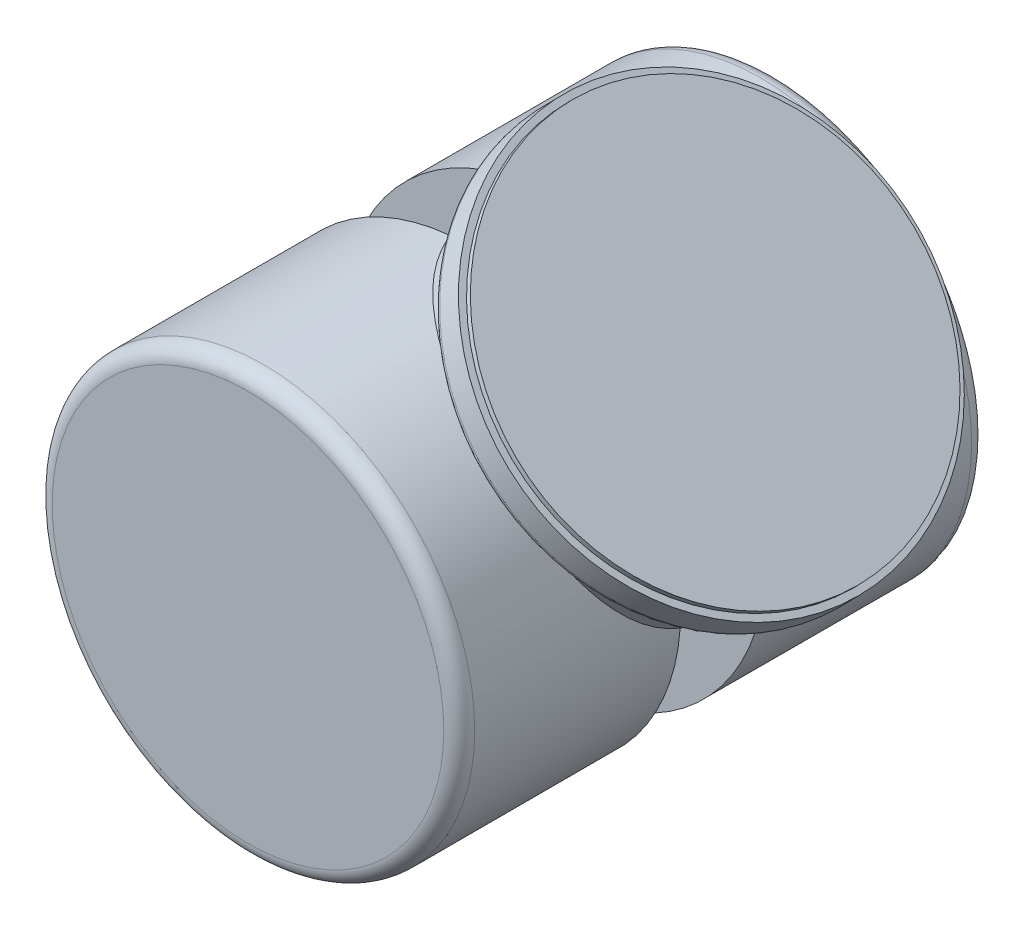
ISO-10303-21;
HEADER;
FILE_DESCRIPTION(('STEP AP214'),'2;1');
FILE_NAME('part.step','',(''),(''),'','','');
FILE_SCHEMA(('AUTOMOTIVE_DESIGN { 1 0 10303 214 1 1 1 1 }'));
ENDSEC;
DATA;
#1=APPLICATION_CONTEXT('core data for automotive mechanical design processes');
#2=APPLICATION_PROTOCOL_DEFINITION('international standard','automotive_design',2000,#1);
#3=PRODUCT_CONTEXT('',#1,'mechanical');
#4=PRODUCT('Part','Part','',(#3));
#5=PRODUCT_RELATED_PRODUCT_CATEGORY('part','',(#4));
#6=PRODUCT_DEFINITION_FORMATION('','',#4);
#7=PRODUCT_DEFINITION_CONTEXT('part definition',#1,'design');
#8=PRODUCT_DEFINITION('design','',#6,#7);
#9=PRODUCT_DEFINITION_SHAPE('','',#8);
#10=(LENGTH_UNIT() NAMED_UNIT(*) SI_UNIT(.MILLI.,.METRE.));
#11=(NAMED_UNIT(*) PLANE_ANGLE_UNIT() SI_UNIT($,.RADIAN.));
#12=(NAMED_UNIT(*) SI_UNIT($,.STERADIAN.) SOLID_ANGLE_UNIT());
#13=UNCERTAINTY_MEASURE_WITH_UNIT(LENGTH_MEASURE(1.E-05),#10,'distance_accuracy_value','');
#14=(GEOMETRIC_REPRESENTATION_CONTEXT(3) GLOBAL_UNCERTAINTY_ASSIGNED_CONTEXT((#13)) GLOBAL_UNIT_ASSIGNED_CONTEXT((#10,
#11,#12)) REPRESENTATION_CONTEXT('',''));
#15=CARTESIAN_POINT('',(0.,0.,0.));
#16=DIRECTION('',(0.,0.,1.));
#17=DIRECTION('',(1.,0.,0.));
#18=AXIS2_PLACEMENT_3D('',#15,#16,#17);
#19=CARTESIAN_POINT('',(-10.2728885897639,17.7877716934821,91.179723483677));
#20=DIRECTION('',(0.,0.,-1.));
#21=DIRECTION('',(-1.,0.,0.));
#22=AXIS2_PLACEMENT_3D('',#19,#20,#21);
#23=CYLINDRICAL_SURFACE('',#22,72.9880409571441);
#24=CARTESIAN_POINT('',(-10.2728885897639,17.7877716934821,-85.839210669677));
#25=DIRECTION('',(0.,0.,1.));
#26=DIRECTION('',(1.,0.,0.));
#27=AXIS2_PLACEMENT_3D('',#24,#25,#26);
#28=CIRCLE('',#27,72.9880409571441);
#29=CARTESIAN_POINT('',(62.7151523673802,17.7877716934821,-85.839210669677));
#30=VERTEX_POINT('',#29);
#31=EDGE_CURVE('E119',#30,#30,#28,.T.);
#32=ORIENTED_EDGE('',*,*,#31,.T.);
#33=EDGE_LOOP('',(#32));
#34=FACE_BOUND('',#33,.T.);
#35=CARTESIAN_POINT('',(-10.2728885897639,17.7877716934821,-14.6864102385));
#36=DIRECTION('',(0.,0.,1.));
#37=DIRECTION('',(1.,0.,0.));
#38=AXIS2_PLACEMENT_3D('',#35,#36,#37);
#39=CIRCLE('',#38,72.9880409571441);
#40=CARTESIAN_POINT('',(-16.9343529286447,90.4711880662941,-14.6864102385));
#41=VERTEX_POINT('',#40);
#42=CARTESIAN_POINT('',(62.5395750697728,12.7282007047142,-14.6864102385));
#43=VERTEX_POINT('',#42);
#44=EDGE_CURVE('E46',#41,#43,#39,.T.);
#45=ORIENTED_EDGE('',*,*,#44,.F.);
#46=CARTESIAN_POINT('',(-12.460816977514,90.7430120270717,-23.0457855003548));
#47=CARTESIAN_POINT('',(-11.9340405390179,90.7588120435122,-23.8551228879082));
#48=CARTESIAN_POINT('',(-11.3881053483468,90.7694651302793,-24.651996051726));
#49=CARTESIAN_POINT('',(-10.2618581155566,90.7779839909645,-26.2212619687137));
#50=CARTESIAN_POINT('',(-9.68154228267833,90.7758483522088,-26.9936520079439));
#51=CARTESIAN_POINT('',(-8.48987887696964,90.756465774077,-28.5144142634714));
#52=CARTESIAN_POINT('',(-7.87851794744228,90.7392122776759,-29.2627759119824));
#53=CARTESIAN_POINT('',(-6.62806677772549,90.6874354779252,-30.7352856678141));
#54=CARTESIAN_POINT('',(-5.98897741390968,90.6529127200184,-31.4594345391151));
#55=CARTESIAN_POINT('',(-4.68475511102175,90.5645175895748,-32.8846410294117));
#56=CARTESIAN_POINT('',(-4.01958482280416,90.5106164922079,-33.5856626733933));
#57=CARTESIAN_POINT('',(-2.66648075490148,90.3815635382052,-34.9633577484608));
#58=CARTESIAN_POINT('',(-1.97854682005504,90.3064115366927,-35.6400310135178));
#59=CARTESIAN_POINT('',(-0.582201910021823,90.133051592688,-36.9686029353508));
#60=CARTESIAN_POINT('',(0.126205059318272,90.0348481341226,-37.6205063816891));
#61=CARTESIAN_POINT('',(1.56156053767148,89.8136520626764,-38.8991213189813));
#62=CARTESIAN_POINT('',(2.28850902592742,89.6906594775458,-39.5258328381355));
#63=CARTESIAN_POINT('',(4.49913442568045,89.2810685649075,-41.371228637966));
#64=CARTESIAN_POINT('',(6.00828969956524,88.9543667605424,-42.5510953401129));
#65=CARTESIAN_POINT('',(9.07903094136688,88.181407026149,-44.7992657590915));
#66=CARTESIAN_POINT('',(10.640624102946,87.7351326335313,-45.8675540857973));
#67=CARTESIAN_POINT('',(13.0076754800586,86.9683757652841,-47.3763347548361));
#68=CARTESIAN_POINT('',(13.799891168629,86.6969284646599,-47.8631541348013));
#69=CARTESIAN_POINT('',(15.3911479565673,86.1202470714299,-48.8046173654142));
#70=CARTESIAN_POINT('',(16.1901886194247,85.8150151249043,-49.2592632567931));
#71=CARTESIAN_POINT('',(17.7923570498521,85.1698281590307,-50.1344068217745));
#72=CARTESIAN_POINT('',(18.5954824673839,84.8298913400642,-50.5549221889509));
#73=CARTESIAN_POINT('',(20.2039105935849,84.1141912916135,-51.3603100854198));
#74=CARTESIAN_POINT('',(21.0092137774569,83.7384195050016,-51.7451740579498));
#75=CARTESIAN_POINT('',(22.9489593390686,82.7889901391575,-52.6272007127063));
#76=CARTESIAN_POINT('',(24.0831332649281,82.1973147384143,-53.1058059716641));
#77=CARTESIAN_POINT('',(26.341792453711,80.9406675625587,-53.9826188172451));
#78=CARTESIAN_POINT('',(27.4662800383292,80.2757139099318,-54.3808462134863));
#79=CARTESIAN_POINT('',(29.1387111362293,79.2240323661206,-54.9139469186251));
#80=CARTESIAN_POINT('',(29.6937568411615,78.8644638470574,-55.0809286190994));
#81=CARTESIAN_POINT('',(30.798019687843,78.1274350282599,-55.3929388972209));
#82=CARTESIAN_POINT('',(31.3472378308829,77.7499778651322,-55.5379713049074));
#83=CARTESIAN_POINT('',(32.4387819192478,76.97742038648,-55.805570342904));
#84=CARTESIAN_POINT('',(32.981107110373,76.5823181612904,-55.928134534192));
#85=CARTESIAN_POINT('',(34.0576531936794,75.7749244975751,-56.1503066567562));
#86=CARTESIAN_POINT('',(34.5918737144183,75.3626322744468,-56.2499135388351));
#87=CARTESIAN_POINT('',(35.6531710042535,74.5197051265467,-56.4261175213798));
#88=CARTESIAN_POINT('',(36.1802095314599,74.0890019633498,-56.5026186647049));
#89=CARTESIAN_POINT('',(37.2237735458791,73.2114671954752,-56.6317423873246));
#90=CARTESIAN_POINT('',(37.7402979722484,72.764633975811,-56.6843625683916));
#91=CARTESIAN_POINT('',(38.7615897535056,71.8557040025734,-56.7654817499431));
#92=CARTESIAN_POINT('',(39.2663582779038,71.3936087784627,-56.7939831598851));
#93=CARTESIAN_POINT('',(40.2631583837219,70.4549417818142,-56.8267507282682));
#94=CARTESIAN_POINT('',(40.7551886379367,69.978368511957,-56.8310143714025));
#95=CARTESIAN_POINT('',(41.7253901935651,69.01180855014,-56.8152814734158));
#96=CARTESIAN_POINT('',(42.2035629645859,68.5218232913383,-56.7952875145617));
#97=CARTESIAN_POINT('',(43.1452203280086,67.529381593695,-56.731128977962));
#98=CARTESIAN_POINT('',(43.6087033033593,67.0269237926585,-56.6869617489341));
#99=CARTESIAN_POINT('',(44.5200305411271,66.010751444427,-56.5746507975141));
#100=CARTESIAN_POINT('',(44.9678769858662,65.4970384844845,-56.5065104357693));
#101=CARTESIAN_POINT('',(45.8472783683929,64.4594309220142,-56.346548878386));
#102=CARTESIAN_POINT('',(46.278831751186,63.9355353548596,-56.2547254289725));
#103=CARTESIAN_POINT('',(47.4948055018622,62.4168586156077,-55.957293235095));
#104=CARTESIAN_POINT('',(48.2580607135594,61.4106234031221,-55.7223682880931));
#105=CARTESIAN_POINT('',(49.7217986219112,59.3746024129492,-55.1738803481642));
#106=CARTESIAN_POINT('',(50.4222845049317,58.3448178340355,-54.8603213500188));
#107=CARTESIAN_POINT('',(51.7591048704046,56.2690648608736,-54.158471024652));
#108=CARTESIAN_POINT('',(52.3954312922362,55.2230944521258,-53.7701703251016));
#109=CARTESIAN_POINT('',(53.6034481269408,53.1224041183685,-52.9232510798212));
#110=CARTESIAN_POINT('',(54.1751348305662,52.0676836949773,-52.4646285023362));
#111=CARTESIAN_POINT('',(55.2987921287767,49.869764728542,-51.4413234417483));
#112=CARTESIAN_POINT('',(55.8453127772874,48.726394886213,-50.871030764956));
#113=CARTESIAN_POINT('',(56.8655574004808,46.4451418742561,-49.6590603693155));
#114=CARTESIAN_POINT('',(57.3392781479352,45.3072589500284,-49.0173794879921));
#115=CARTESIAN_POINT('',(58.2170474373938,43.0436017206231,-47.6676246660628));
#116=CARTESIAN_POINT('',(58.6210721151461,41.9178316861772,-46.9595281120347));
#117=CARTESIAN_POINT('',(59.3629057142515,39.6851325305964,-45.4817574769344));
#118=CARTESIAN_POINT('',(59.700711313206,38.5782043573543,-44.7120803089152));
#119=CARTESIAN_POINT('',(60.3745301858172,36.1738037350256,-42.9580427112978));
#120=CARTESIAN_POINT('',(60.697138525241,34.8816472383107,-41.9612220645938));
#121=CARTESIAN_POINT('',(61.2611088446574,32.3422685932456,-39.8902281704483));
#122=CARTESIAN_POINT('',(61.5024581544501,31.0950534793654,-38.8160428917035));
#123=CARTESIAN_POINT('',(61.9123666186016,28.6540618014856,-36.5926538433271));
#124=CARTESIAN_POINT('',(62.0808378494649,27.4603513349315,-35.4433613734638));
#125=CARTESIAN_POINT('',(62.3534140177432,25.1389304474795,-33.072925262155));
#126=CARTESIAN_POINT('',(62.4575257795088,24.0112130404975,-31.851789253676));
#127=CARTESIAN_POINT('',(62.6050873156042,21.9190556624388,-29.4355177981187));
#128=CARTESIAN_POINT('',(62.652618813494,20.9487365471376,-28.2457228343316));
#129=CARTESIAN_POINT('',(62.7095184402112,19.0874118727049,-25.8042579889513));
#130=CARTESIAN_POINT('',(62.718881706242,18.1964164338942,-24.5525802437858));
#131=CARTESIAN_POINT('',(62.7088418389203,16.5110374338059,-21.988633337761));
#132=CARTESIAN_POINT('',(62.6894871774036,15.7164935231724,-20.6764698882142));
#133=CARTESIAN_POINT('',(62.6327158583367,14.2422145142303,-17.9895452380886));
#134=CARTESIAN_POINT('',(62.5953078064356,13.5624249232718,-16.6148141446003));
#135=CARTESIAN_POINT('',(62.5268718817214,12.5316298800338,-14.2428665060286));
#136=CARTESIAN_POINT('',(62.4974849837251,12.1441619234831,-13.2614081876951));
#137=CARTESIAN_POINT('',(62.4397543268477,11.4435374545588,-11.2721850527926));
#138=CARTESIAN_POINT('',(62.4114104260707,11.1303708019495,-10.2644238467594));
#139=CARTESIAN_POINT('',(62.3596356173175,10.5874174107319,-8.22846465564144));
#140=CARTESIAN_POINT('',(62.3361953713456,10.3574715740195,-7.20030967243771));
#141=CARTESIAN_POINT('',(62.2973954271077,9.98758905494106,-5.12764666331666));
#142=CARTESIAN_POINT('',(62.2820355561892,9.84765044938523,-4.0831389872968));
#143=CARTESIAN_POINT('',(62.2615191771608,9.66233165596428,-1.9786777847436));
#144=CARTESIAN_POINT('',(62.2564301322192,9.61757657157751,-0.918667904603441));
#145=CARTESIAN_POINT('',(62.2574078955824,9.62626369080663,1.20091102150001));
#146=CARTESIAN_POINT('',(62.2634744546485,9.67970370054676,2.2604800767832));
#147=CARTESIAN_POINT('',(62.2858829375398,9.88276957853483,4.3713088678319));
#148=CARTESIAN_POINT('',(62.3022358582556,10.0324983905572,5.42255849004623));
#149=CARTESIAN_POINT('',(62.342866269291,10.4226925737378,7.50787105465069));
#150=CARTESIAN_POINT('',(62.36714494735,10.6631715453917,8.54193139666315));
#151=CARTESIAN_POINT('',(62.4262149189626,11.2904866289181,10.8167150484546));
#152=CARTESIAN_POINT('',(62.4621425922467,11.6980647125633,12.0516837282932));
#153=CARTESIAN_POINT('',(62.533554575026,12.6215586457339,14.4802867839585));
#154=CARTESIAN_POINT('',(62.5690387571636,13.1375048909673,15.6739094531711));
#155=CARTESIAN_POINT('',(62.6321918214466,14.263307813988,18.0194419400734));
#156=CARTESIAN_POINT('',(62.6598415926251,14.8733886204842,19.1712438810069));
#157=CARTESIAN_POINT('',(62.7001742863296,16.1726908753276,21.4294440560144));
#158=CARTESIAN_POINT('',(62.7128563657336,16.8619167794766,22.5358397289896));
#159=CARTESIAN_POINT('',(62.7163461959453,18.1146552356003,24.413891420098));
#160=CARTESIAN_POINT('',(62.7120914643624,18.6625803337304,25.1960293292262));
#161=CARTESIAN_POINT('',(62.6898408992001,19.7909085300371,26.7364305116138));
#162=CARTESIAN_POINT('',(62.6718438084712,20.3713145950676,27.4946915940153));
#163=CARTESIAN_POINT('',(62.6199699104208,21.5613957774964,28.9877284891983));
#164=CARTESIAN_POINT('',(62.586087427416,22.1710812861922,29.7224958075943));
#165=CARTESIAN_POINT('',(62.5004581100575,23.4166082794116,31.1683935992141));
#166=CARTESIAN_POINT('',(62.4487117436209,24.0524490784532,31.8795246910179));
#167=CARTESIAN_POINT('',(62.325429039534,25.3483586749335,33.2788451382128));
#168=CARTESIAN_POINT('',(62.2538737983592,26.0084500901549,33.9670118723689));
#169=CARTESIAN_POINT('',(62.0892127453046,27.3500531196286,35.3195985922556));
#170=CARTESIAN_POINT('',(61.9961049458603,28.0315667044085,35.9840163813446));
#171=CARTESIAN_POINT('',(61.7866684024935,29.413727341643,37.2885819500871));
#172=CARTESIAN_POINT('',(61.6703442351537,30.1143705996543,37.9287344835402));
#173=CARTESIAN_POINT('',(61.4128384141506,31.5329657739076,39.1843958491386));
#174=CARTESIAN_POINT('',(61.2716567783189,32.250917677733,39.7999046989619));
#175=CARTESIAN_POINT('',(60.9600645481877,33.7154564521156,41.0165444037648));
#176=CARTESIAN_POINT('',(60.7891693451122,34.4623266026475,41.617210603426));
#177=CARTESIAN_POINT('',(60.4183926529167,35.9701719448283,42.7913704539775));
#178=CARTESIAN_POINT('',(60.2185099024291,36.7311477490147,43.3648629209855));
#179=CARTESIAN_POINT('',(59.7882101569714,38.2653546715047,44.4836170582766));
#180=CARTESIAN_POINT('',(59.5577880138192,39.0385878367032,45.0288739471433));
#181=CARTESIAN_POINT('',(59.0650089314447,40.5951496476204,46.0897204344723));
#182=CARTESIAN_POINT('',(58.8026530823863,41.3784779478923,46.6053110448079));
#183=CARTESIAN_POINT('',(58.2453294992028,42.9512834091064,47.6041681313053));
#184=CARTESIAN_POINT('',(57.9504405833521,43.7407415815006,48.0875083677253));
#185=CARTESIAN_POINT('',(57.3263744523874,45.3253611124644,49.0215280844768));
#186=CARTESIAN_POINT('',(56.9971993995128,46.1205221084466,49.4722096213781));
#187=CARTESIAN_POINT('',(56.3036949651996,47.7137975096482,50.3389420595258));
#188=CARTESIAN_POINT('',(55.9393845020555,48.5119101054297,50.7550113750452));
#189=CARTESIAN_POINT('',(55.1745738719031,50.1090972352836,51.5509871324121));
#190=CARTESIAN_POINT('',(54.7740651029658,50.9081719532412,51.9308849344224));
#191=CARTESIAN_POINT('',(53.7683519912876,52.8244311883863,52.7971576818828));
#192=CARTESIAN_POINT('',(53.1454483461387,53.9407372190159,53.2651736431386));
#193=CARTESIAN_POINT('',(51.8270667955861,56.1611423472303,54.1207282023049));
#194=CARTESIAN_POINT('',(51.1316069419988,57.2652444058898,54.5082867464294));
#195=CARTESIAN_POINT('',(50.0350036901434,58.905227995704,55.0253984851113));
#196=CARTESIAN_POINT('',(49.660609472733,59.4491375721787,55.1870510085295));
#197=CARTESIAN_POINT('',(48.8942488912748,60.530523630589,55.4884270534376));
#198=CARTESIAN_POINT('',(48.5022856169854,61.0680012227756,55.628154411465));
#199=CARTESIAN_POINT('',(47.7010782588391,62.1354746623872,55.8851845421421));
#200=CARTESIAN_POINT('',(47.2918322904532,62.6654696854513,56.0024848615682));
#201=CARTESIAN_POINT('',(46.4565596097798,63.7167882407612,56.2141904253908));
#202=CARTESIAN_POINT('',(46.0305321301076,64.2381113749049,56.3085946213775));
#203=CARTESIAN_POINT('',(45.1606071568673,65.2729311410164,56.4744402746004));
#204=CARTESIAN_POINT('',(44.7166461046232,65.7863890373479,56.5457901779548));
#205=CARTESIAN_POINT('',(43.8130968691838,66.8022843595795,56.6647246551538));
#206=CARTESIAN_POINT('',(43.3535071241671,67.3047206757581,56.7123068463223));
#207=CARTESIAN_POINT('',(42.4196051385906,68.2973703813711,56.7834868137555));
#208=CARTESIAN_POINT('',(41.9452943826038,68.7875849943969,56.8070870004915));
#209=CARTESIAN_POINT('',(40.9827669447659,69.7548522745364,56.8302099092127));
#210=CARTESIAN_POINT('',(40.4945488294618,70.2319035748378,56.8297301401996));
#211=CARTESIAN_POINT('',(39.5052856343097,71.1717857392582,56.8046897654828));
#212=CARTESIAN_POINT('',(39.0042415679435,71.6346177206404,56.7801310567652));
#213=CARTESIAN_POINT('',(37.9903011723121,72.5452648107826,56.7070395254539));
#214=CARTESIAN_POINT('',(37.4774035583762,72.9930782788434,56.658504092572));
#215=CARTESIAN_POINT('',(36.4409867683533,73.8727950942771,56.5376710259522));
#216=CARTESIAN_POINT('',(35.9174690548793,74.3047006097516,56.4653766437579));
#217=CARTESIAN_POINT('',(34.8608964597806,75.1519977251248,56.2973347207815));
#218=CARTESIAN_POINT('',(34.3278406759284,75.5673877506834,56.2015849503137));
#219=CARTESIAN_POINT('',(32.7802023425943,76.7393644753665,55.8924997301022));
#220=CARTESIAN_POINT('',(31.7548745561229,77.4743555289217,55.6498598101908));
#221=CARTESIAN_POINT('',(29.6828078526145,78.8808585187072,55.0862912299105));
#222=CARTESIAN_POINT('',(28.636069972533,79.5523735204605,54.7653663529314));
#223=CARTESIAN_POINT('',(26.5285500612643,80.8308308690549,54.0491852797664));
#224=CARTESIAN_POINT('',(25.4677663036181,81.4377651934944,53.6539198656199));
#225=CARTESIAN_POINT('',(23.33954827202,82.5868543096366,52.7934988440028));
#226=CARTESIAN_POINT('',(22.2721136179532,83.1290053624151,52.328339206127));
#227=CARTESIAN_POINT('',(20.0459217285584,84.193142512449,51.2900468150707));
#228=CARTESIAN_POINT('',(18.8871656338845,84.7094338156419,50.7110809247253));
#229=CARTESIAN_POINT('',(16.5774651688239,85.6691165435233,49.4817778067637));
#230=CARTESIAN_POINT('',(15.4265211660196,86.112504560378,48.8314372451362));
#231=CARTESIAN_POINT('',(13.1389662920976,86.9297627169136,47.46436060154));
#232=CARTESIAN_POINT('',(12.0023608754642,87.3036071034374,46.7476000697764));
#233=CARTESIAN_POINT('',(9.75018178827739,87.9854597145582,45.2525010667761));
#234=CARTESIAN_POINT('',(8.63460916023461,88.2934646835422,44.4741595531026));
#235=CARTESIAN_POINT('',(6.21178343957606,88.902915405232,42.6997558017159));
#236=CARTESIAN_POINT('',(4.91035523616277,89.1909654627242,41.6911144290501));
#237=CARTESIAN_POINT('',(2.3555181053871,89.6868060523182,39.5961280852117));
#238=CARTESIAN_POINT('',(1.10211691613542,89.8945836995068,38.5097706726014));
#239=CARTESIAN_POINT('',(-1.34808966772504,90.2386797604082,36.2616226370198));
#240=CARTESIAN_POINT('',(-2.54482798352344,90.3749153148506,35.0997462906051));
#241=CARTESIAN_POINT('',(-4.86908928091771,90.5848457388874,32.7035668265583));
#242=CARTESIAN_POINT('',(-5.99662039925807,90.6585479736892,31.4692722566963));
#243=CARTESIAN_POINT('',(-8.06688353105219,90.7491150983787,29.048315663639));
#244=CARTESIAN_POINT('',(-9.01701295258076,90.7706883279945,27.8681549956938));
#245=CARTESIAN_POINT('',(-10.8379210979505,90.7793022312633,25.4475263568768));
#246=CARTESIAN_POINT('',(-11.7086907416497,90.7663389584556,24.2070515098496));
#247=CARTESIAN_POINT('',(-13.3541110314611,90.7153831254172,21.667123974396));
#248=CARTESIAN_POINT('',(-14.128923165516,90.6774333145223,20.367775541841));
#249=CARTESIAN_POINT('',(-15.5649164971628,90.5872635606498,17.7082086546415));
#250=CARTESIAN_POINT('',(-16.2261496786119,90.5350501744541,16.3480184078613));
#251=CARTESIAN_POINT('',(-17.231804588861,90.4444975876709,13.991956305862));
#252=CARTESIAN_POINT('',(-17.6114256692706,90.4067665749669,13.0110502244693));
#253=CARTESIAN_POINT('',(-18.2961170056579,90.3343121566596,11.0233466804696));
#254=CARTESIAN_POINT('',(-18.6011973847283,90.2995883430739,10.016552754142));
#255=CARTESIAN_POINT('',(-19.1279715510434,90.2371482572664,7.98300914263365));
#256=CARTESIAN_POINT('',(-19.3498201492393,90.209419006979,6.95630027947668));
#257=CARTESIAN_POINT('',(-19.7037354139835,90.1641859377054,4.88716986294642));
#258=CARTESIAN_POINT('',(-19.8358040715179,90.1466818919632,3.84474865853868));
#259=CARTESIAN_POINT('',(-20.0058490798368,90.124008836764,1.74552218346993));
#260=CARTESIAN_POINT('',(-20.0432362949727,90.118917067418,0.688667791865095));
#261=CARTESIAN_POINT('',(-20.0207399056753,90.1219518057175,-1.42395535457493));
#262=CARTESIAN_POINT('',(-19.9608576993528,90.1300781233718,-2.47972412479613));
#263=CARTESIAN_POINT('',(-19.7460454560199,90.1585183789749,-4.58243351321721));
#264=CARTESIAN_POINT('',(-19.5910132962395,90.1788454112187,-5.62936341926232));
#265=CARTESIAN_POINT('',(-19.1914339479923,90.2291541321959,-7.70569927633962));
#266=CARTESIAN_POINT('',(-18.9468751245683,90.2591370757584,-8.73510293144052));
#267=CARTESIAN_POINT('',(-18.3303957758446,90.3304596545764,-10.9330755766847));
#268=CARTESIAN_POINT('',(-17.9443806178221,90.3728479840374,-12.0976451768177));
#269=CARTESIAN_POINT('',(-17.0758149396475,90.4593913019738,-14.3899602669268));
#270=CARTESIAN_POINT('',(-16.5932474336852,90.5035466002051,-15.5176992368719));
#271=CARTESIAN_POINT('',(-15.5437111132685,90.5871540936589,-17.7357576363332));
#272=CARTESIAN_POINT('',(-14.9765815360498,90.626597067153,-18.8260008145597));
#273=CARTESIAN_POINT('',(-13.7702492406243,90.6944752767882,-20.9661525402132));
#274=CARTESIAN_POINT('',(-13.1310399435548,90.7229095070872,-22.0160573941349));
#275=CARTESIAN_POINT('',(-12.460816977514,90.7430120270717,-23.0457855003548));
#276=B_SPLINE_CURVE_WITH_KNOTS('',3,(#46,#47,#48,#49,#50,#51,#52,#53,#54,#55,#56,#57,#58,#59,
#60,#61,#62,#63,#64,#65,#66,#67,#68,#69,#70,#71,#72,#73,#74,#75,#76,#77,#78,#79,#80,#81,#82,#83,
#84,#85,#86,#87,#88,#89,#90,#91,#92,#93,#94,#95,#96,#97,#98,#99,#100,#101,#102,#103,#104,#105,
#106,#107,#108,#109,#110,#111,#112,#113,#114,#115,#116,#117,#118,#119,#120,#121,#122,#123,#124,
#125,#126,#127,#128,#129,#130,#131,#132,#133,#134,#135,#136,#137,#138,#139,#140,#141,#142,#143,
#144,#145,#146,#147,#148,#149,#150,#151,#152,#153,#154,#155,#156,#157,#158,#159,#160,#161,#162,
#163,#164,#165,#166,#167,#168,#169,#170,#171,#172,#173,#174,#175,#176,#177,#178,#179,#180,#181,
#182,#183,#184,#185,#186,#187,#188,#189,#190,#191,#192,#193,#194,#195,#196,#197,#198,#199,#200,
#201,#202,#203,#204,#205,#206,#207,#208,#209,#210,#211,#212,#213,#214,#215,#216,#217,#218,#219,
#220,#221,#222,#223,#224,#225,#226,#227,#228,#229,#230,#231,#232,#233,#234,#235,#236,#237,#238,
#239,#240,#241,#242,#243,#244,#245,#246,#247,#248,#249,#250,#251,#252,#253,#254,#255,#256,#257,
#258,#259,#260,#261,#262,#263,#264,#265,#266,#267,#268,#269,#270,#271,#272,#273,#274,#275),
.UNSPECIFIED.,.T.,.F.,(4,2,2,2,2,2,2,2,2,2,2,2,2,2,2,2,2,2,2,2,2,2,2,2,2,2,2,2,2,2,2,2,2,2,2,2,
2,2,2,2,2,2,2,2,2,2,2,2,2,2,2,2,2,2,2,2,2,2,2,2,2,2,2,2,2,2,2,2,2,2,2,2,2,2,2,2,2,2,2,2,2,2,2,2,
2,2,2,2,2,2,2,2,2,2,2,2,2,2,2,2,2,2,2,2,2,2,2,2,2,2,2,2,2,2,4),(0.,2.89701983474946,
5.79435968729054,8.69295681713232,11.5914624017312,14.4942823243303,17.3971220371814,
20.2993975622427,23.2016698383584,29.0240078388824,34.8471478631639,37.7521409819766,
40.6569496745885,43.5602427395744,46.4642308340021,50.5574851890914,54.6497295013699,
56.6954936294589,58.7409003695429,60.7865290160655,62.8322511335876,64.8863557872437,
66.9406666771752,68.994772317869,71.0490911222527,73.1031912597775,75.1575167326035,
77.211554336735,79.265787483265,83.11499885358,86.9640147151552,90.8135135436862,
94.6632331576027,98.8282633259587,102.993478077368,107.160116198588,111.326963318364,
116.31288410682,121.299581958313,126.292279327639,131.284447205891,135.889078212521,
140.494295850571,145.091749363722,149.687013534459,152.851229521217,156.015013424358,
159.172716582065,162.330352266704,165.508662017517,168.686900759366,171.868543064678,
175.050662384115,178.947581870314,182.84559584942,186.753038206007,190.660700656236,
193.524715864421,196.388993103825,199.254294500102,202.119520849891,204.987490954884,
207.855725647869,210.723395490595,213.591063276175,216.510852003581,219.430767821146,
222.351176491455,225.271485491787,228.184868660489,231.098068209142,234.009707841381,
236.922041205016,241.001755371996,245.080456925256,247.119376212216,249.157938323564,
251.19672329944,253.23560161333,255.282480010935,257.329563563741,259.376441340395,
261.423530860783,263.470459120417,265.517610273333,267.564481378869,269.611547136971,
273.460926491067,277.310119847516,281.159790805218,285.009683836961,289.188996088662,
293.368503645066,297.549555874524,301.730814799937,306.740676560554,311.751342144558,
316.767798298288,321.783663529124,326.326068299507,330.868992149395,335.404163661728,
339.937253912061,343.092135592915,346.246588582692,349.395144860212,352.543631312149,
355.711660962522,358.879645077335,362.05103529418,365.222837813855,368.900676483258,
372.579162740076,376.264733579453,379.950641081064),.UNSPECIFIED.);
#277=EDGE_CURVE('E78',#41,#43,#276,.T.);
#278=ORIENTED_EDGE('',*,*,#277,.T.);
#279=EDGE_LOOP('',(#45,#278));
#280=FACE_BOUND('',#279,.T.);
#281=ADVANCED_FACE('F32',(#34,#280),#23,.T.);
#282=CARTESIAN_POINT('',(-10.2728885897639,17.7877716934821,85.839210669677));
#283=DIRECTION('',(0.,0.,1.));
#284=DIRECTION('',(1.,0.,0.));
#285=AXIS2_PLACEMENT_3D('',#282,#283,#284);
#286=CIRCLE('',#285,72.9880409571441);
#287=CARTESIAN_POINT('',(62.7151523673802,17.7877716934821,85.839210669677));
#288=VERTEX_POINT('',#287);
#289=EDGE_CURVE('E81',#288,#288,#286,.F.);
#290=ORIENTED_EDGE('',*,*,#289,.T.);
#291=EDGE_LOOP('',(#290));
#292=FACE_BOUND('',#291,.T.);
#293=CARTESIAN_POINT('',(62.5395750697728,12.7282007047141,14.6864102385));
#294=VERTEX_POINT('',#293);
#295=CARTESIAN_POINT('',(-16.9343529286447,90.4711880662941,14.6864102385));
#296=VERTEX_POINT('',#295);
#297=EDGE_CURVE('E76',#294,#296,#276,.T.);
#298=ORIENTED_EDGE('',*,*,#297,.T.);
#299=CARTESIAN_POINT('',(-10.2728885897639,17.7877716934821,14.6864102385));
#300=DIRECTION('',(0.,0.,1.));
#301=DIRECTION('',(1.,0.,0.));
#302=AXIS2_PLACEMENT_3D('',#299,#300,#301);
#303=CIRCLE('',#302,72.9880409571441);
#304=EDGE_CURVE('E66',#296,#294,#303,.T.);
#305=ORIENTED_EDGE('',*,*,#304,.T.);
#306=EDGE_LOOP('',(#298,#305));
#307=FACE_BOUND('',#306,.T.);
#308=ADVANCED_FACE('F80',(#292,#307),#23,.T.);
#309=CARTESIAN_POINT('',(-10.2728885897639,17.7877716934821,91.179723483677));
#310=DIRECTION('',(0.,0.,1.));
#311=DIRECTION('',(1.,0.,0.));
#312=AXIS2_PLACEMENT_3D('',#309,#310,#311);
#313=PLANE('',#312);
#314=CARTESIAN_POINT('',(-10.2728885897639,17.7877716934821,91.179723483677));
#315=DIRECTION('',(0.,0.,1.));
#316=DIRECTION('',(1.,0.,0.));
#317=AXIS2_PLACEMENT_3D('',#314,#315,#316);
#318=CIRCLE('',#317,67.647528143144);
#319=CARTESIAN_POINT('',(57.3746395533802,17.7877716934821,91.179723483677));
#320=VERTEX_POINT('',#319);
#321=EDGE_CURVE('E11',#320,#320,#318,.T.);
#322=ORIENTED_EDGE('',*,*,#321,.T.);
#323=EDGE_LOOP('',(#322));
#324=FACE_BOUND('',#323,.T.);
#325=ADVANCED_FACE('F102',(#324),#313,.T.);
#326=CARTESIAN_POINT('',(-10.2728885897639,17.7877716934821,-91.179723483677));
#327=DIRECTION('',(0.,0.,1.));
#328=DIRECTION('',(1.,0.,0.));
#329=AXIS2_PLACEMENT_3D('',#326,#327,#328);
#330=PLANE('',#329);
#331=CARTESIAN_POINT('',(-10.2728885897639,17.7877716934821,-91.179723483677));
#332=DIRECTION('',(0.,0.,1.));
#333=DIRECTION('',(1.,0.,0.));
#334=AXIS2_PLACEMENT_3D('',#331,#332,#333);
#335=CIRCLE('',#334,67.647528143144);
#336=CARTESIAN_POINT('',(57.3746395533802,17.7877716934821,-91.179723483677));
#337=VERTEX_POINT('',#336);
#338=EDGE_CURVE('E40',#337,#337,#335,.F.);
#339=ORIENTED_EDGE('',*,*,#338,.T.);
#340=EDGE_LOOP('',(#339));
#341=FACE_BOUND('',#340,.T.);
#342=ADVANCED_FACE('F99',(#341),#330,.F.);
#343=CARTESIAN_POINT('',(6.00695650067431,34.4300860738821,0.));
#344=DIRECTION('',(-0.699279233487016,-0.714848622866276,0.));
#345=DIRECTION('',(0.714848622866276,-0.699279233487016,0.));
#346=AXIS2_PLACEMENT_3D('',#343,#344,#345);
#347=CONICAL_SURFACE('',#346,58.1201828103461,0.0260106726611311);
#348=CARTESIAN_POINT('',(43.5366173465885,72.7953414505646,0.));
#349=DIRECTION('',(-0.699279233487016,-0.714848622866276,0.));
#350=DIRECTION('',(0.714848622866276,-0.699279233487016,0.));
#351=AXIS2_PLACEMENT_3D('',#348,#349,#350);
#352=CIRCLE('',#351,56.7238994934229);
#353=CARTESIAN_POINT('',(84.0856187830669,33.1294964924094,0.));
#354=VERTEX_POINT('',#353);
#355=EDGE_CURVE('E89',#354,#354,#352,.T.);
#356=ORIENTED_EDGE('',*,*,#355,.T.);
#357=EDGE_LOOP('',(#356));
#358=FACE_BOUND('',#357,.T.);
#359=EDGE_CURVE('E63',#43,#294,#276,.T.);
#360=ORIENTED_EDGE('',*,*,#359,.F.);
#361=ORIENTED_EDGE('',*,*,#277,.F.);
#362=EDGE_CURVE('E53',#296,#41,#276,.T.);
#363=ORIENTED_EDGE('',*,*,#362,.F.);
#364=ORIENTED_EDGE('',*,*,#297,.F.);
#365=EDGE_LOOP('',(#360,#361,#363,#364));
#366=FACE_BOUND('',#365,.T.);
#367=ADVANCED_FACE('F75',(#358,#366),#347,.T.);
#368=CARTESIAN_POINT('',(43.5851804249926,72.8449857815513,0.));
#369=DIRECTION('',(-0.699279233487016,-0.714848622866276,0.));
#370=DIRECTION('',(0.714848622866276,-0.699279233487016,0.));
#371=AXIS2_PLACEMENT_3D('',#368,#369,#370);
#372=TOROIDAL_SURFACE('',#371,59.3932526635638,2.670256407);
#373=CARTESIAN_POINT('',(45.4518036637149,74.7531692191702,0.));
#374=DIRECTION('',(-0.699279233487016,-0.714848622866276,0.));
#375=DIRECTION('',(0.714848622866276,-0.699279233487016,0.));
#376=AXIS2_PLACEMENT_3D('',#373,#374,#375);
#377=CIRCLE('',#376,59.3238053296827);
#378=CARTESIAN_POINT('',(87.8593442068256,33.2692641006967,0.));
#379=VERTEX_POINT('',#378);
#380=EDGE_CURVE('E139',#379,#379,#377,.T.);
#381=ORIENTED_EDGE('',*,*,#380,.T.);
#382=EDGE_LOOP('',(#381));
#383=FACE_BOUND('',#382,.T.);
#384=ORIENTED_EDGE('',*,*,#355,.F.);
#385=EDGE_LOOP('',(#384));
#386=FACE_BOUND('',#385,.T.);
#387=ADVANCED_FACE('F98',(#383,#386),#372,.F.);
#388=CARTESIAN_POINT('',(45.4518036637149,74.7531692191702,0.));
#389=DIRECTION('',(0.699279233487016,0.714848622866276,0.));
#390=DIRECTION('',(-0.714848622866276,0.699279233487016,0.));
#391=AXIS2_PLACEMENT_3D('',#388,#389,#390);
#392=CONICAL_SURFACE('',#391,59.3238053296827,1.54478565413376);
#393=CARTESIAN_POINT('',(45.5097985479594,74.8124553543079,0.));
#394=DIRECTION('',(-0.699279233487016,-0.714848622866276,0.));
#395=DIRECTION('',(0.714848622866276,-0.699279233487016,0.));
#396=AXIS2_PLACEMENT_3D('',#393,#394,#395);
#397=CIRCLE('',#396,62.5115939377692);
#398=CARTESIAN_POINT('',(90.1961253875496,31.0993958614531,0.));
#399=VERTEX_POINT('',#398);
#400=EDGE_CURVE('E137',#399,#399,#397,.T.);
#401=ORIENTED_EDGE('',*,*,#400,.T.);
#402=EDGE_LOOP('',(#401));
#403=FACE_BOUND('',#402,.T.);
#404=ORIENTED_EDGE('',*,*,#380,.F.);
#405=EDGE_LOOP('',(#404));
#406=FACE_BOUND('',#405,.T.);
#407=ADVANCED_FACE('F147',(#403,#406),#392,.T.);
#408=CARTESIAN_POINT('',(45.5097985479594,74.8124553543079,0.));
#409=DIRECTION('',(0.699279233487016,0.714848622866276,0.));
#410=DIRECTION('',(-0.714848622866276,0.699279233487016,0.));
#411=AXIS2_PLACEMENT_3D('',#408,#409,#410);
#412=CONICAL_SURFACE('',#411,62.5115939377692,0.796407606610247);
#413=CARTESIAN_POINT('',(50.8314338589048,80.2525763978803,0.));
#414=DIRECTION('',(-0.699279233487016,-0.714848622866276,0.));
#415=DIRECTION('',(0.714848622866276,-0.699279233487016,0.));
#416=AXIS2_PLACEMENT_3D('',#413,#414,#415);
#417=CIRCLE('',#416,70.2912058339279);
#418=CARTESIAN_POINT('',(101.079005548898,31.0993958614531,0.));
#419=VERTEX_POINT('',#418);
#420=EDGE_CURVE('E134',#419,#419,#417,.T.);
#421=ORIENTED_EDGE('',*,*,#420,.T.);
#422=EDGE_LOOP('',(#421));
#423=FACE_BOUND('',#422,.T.);
#424=ORIENTED_EDGE('',*,*,#400,.F.);
#425=EDGE_LOOP('',(#424));
#426=FACE_BOUND('',#425,.T.);
#427=ADVANCED_FACE('F151',(#423,#426),#412,.T.);
#428=CARTESIAN_POINT('',(52.1662384194702,81.6171002621994,0.));
#429=DIRECTION('',(-0.699279233487016,-0.714848622866276,0.));
#430=DIRECTION('',(0.714848622866276,-0.699279233487016,0.));
#431=AXIS2_PLACEMENT_3D('',#428,#429,#430);
#432=TOROIDAL_SURFACE('',#431,68.4239509804272,2.670256407);
#433=CARTESIAN_POINT('',(52.1662384194702,81.6171002621994,0.));
#434=DIRECTION('',(-0.699279233487016,-0.714848622866276,0.));
#435=DIRECTION('',(0.714848622866276,-0.699279233487016,0.));
#436=AXIS2_PLACEMENT_3D('',#433,#434,#435);
#437=CIRCLE('',#436,71.0942073874272);
#438=CARTESIAN_POINT('',(102.987834664142,31.9023974149524,0.));
#439=VERTEX_POINT('',#438);
#440=EDGE_CURVE('E131',#439,#439,#437,.T.);
#441=ORIENTED_EDGE('',*,*,#440,.T.);
#442=EDGE_LOOP('',(#441));
#443=FACE_BOUND('',#442,.T.);
#444=ORIENTED_EDGE('',*,*,#420,.F.);
#445=EDGE_LOOP('',(#444));
#446=FACE_BOUND('',#445,.T.);
#447=ADVANCED_FACE('F156',(#443,#446),#432,.T.);
#448=CARTESIAN_POINT('',(6.00695650067432,34.4300860738821,0.));
#449=DIRECTION('',(-0.699279233487016,-0.714848622866276,0.));
#450=DIRECTION('',(0.714848622866276,-0.699279233487016,0.));
#451=AXIS2_PLACEMENT_3D('',#448,#449,#450);
#452=CYLINDRICAL_SURFACE('',#451,71.0942073874271);
#453=CARTESIAN_POINT('',(58.647938048307,88.2431143515951,0.));
#454=DIRECTION('',(-0.699279233487016,-0.714848622866276,0.));
#455=DIRECTION('',(0.714848622866276,-0.699279233487016,0.));
#456=AXIS2_PLACEMENT_3D('',#453,#454,#455);
#457=CIRCLE('',#456,71.0942073874271);
#458=CARTESIAN_POINT('',(109.469534292979,38.5284115043481,0.));
#459=VERTEX_POINT('',#458);
#460=EDGE_CURVE('E128',#459,#459,#457,.T.);
#461=ORIENTED_EDGE('',*,*,#460,.T.);
#462=EDGE_LOOP('',(#461));
#463=FACE_BOUND('',#462,.T.);
#464=ORIENTED_EDGE('',*,*,#440,.F.);
#465=EDGE_LOOP('',(#464));
#466=FACE_BOUND('',#465,.T.);
#467=ADVANCED_FACE('F163',(#463,#466),#452,.T.);
#468=CARTESIAN_POINT('',(107.845331375785,40.1172393129663,0.));
#469=DIRECTION('',(0.699279233487016,0.714848622866276,0.));
#470=DIRECTION('',(-0.714848622866276,0.699279233487016,0.));
#471=AXIS2_PLACEMENT_3D('',#468,#469,#470);
#472=PLANE('',#471);
#473=CARTESIAN_POINT('',(58.647938048307,88.2431143515952,0.));
#474=DIRECTION('',(-0.699279233487016,-0.714848622866276,0.));
#475=DIRECTION('',(0.714848622866276,-0.699279233487016,0.));
#476=AXIS2_PLACEMENT_3D('',#473,#474,#475);
#477=CIRCLE('',#476,68.8221138766627);
#478=CARTESIAN_POINT('',(107.845331375785,40.1172393129664,0.));
#479=VERTEX_POINT('',#478);
#480=EDGE_CURVE('E123',#479,#479,#477,.T.);
#481=ORIENTED_EDGE('',*,*,#480,.T.);
#482=EDGE_LOOP('',(#481));
#483=FACE_BOUND('',#482,.T.);
#484=ORIENTED_EDGE('',*,*,#460,.F.);
#485=EDGE_LOOP('',(#484));
#486=FACE_BOUND('',#485,.T.);
#487=ADVANCED_FACE('F167',(#483,#486),#472,.T.);
#488=CARTESIAN_POINT('',(6.00695650067432,34.4300860738821,0.));
#489=DIRECTION('',(-0.699279233487016,-0.714848622866276,0.));
#490=DIRECTION('',(0.714848622866276,-0.699279233487016,0.));
#491=AXIS2_PLACEMENT_3D('',#488,#489,#490);
#492=CYLINDRICAL_SURFACE('',#491,68.8221138766627);
#493=CARTESIAN_POINT('',(59.9550164457575,89.5792947322658,0.));
#494=DIRECTION('',(-0.699279233487016,-0.714848622866276,0.));
#495=DIRECTION('',(0.714848622866276,-0.699279233487016,0.));
#496=AXIS2_PLACEMENT_3D('',#493,#494,#495);
#497=CIRCLE('',#496,68.8221138766627);
#498=CARTESIAN_POINT('',(109.152409773236,41.453419693637,0.));
#499=VERTEX_POINT('',#498);
#500=EDGE_CURVE('E120',#499,#499,#497,.T.);
#501=ORIENTED_EDGE('',*,*,#500,.T.);
#502=EDGE_LOOP('',(#501));
#503=FACE_BOUND('',#502,.T.);
#504=ORIENTED_EDGE('',*,*,#480,.F.);
#505=EDGE_LOOP('',(#504));
#506=FACE_BOUND('',#505,.T.);
#507=ADVANCED_FACE('F171',(#503,#506),#492,.T.);
#508=CARTESIAN_POINT('',(59.9550164457575,89.5792947322658,0.));
#509=DIRECTION('',(0.699279233487016,0.714848622866276,0.));
#510=DIRECTION('',(-0.714848622866276,0.699279233487016,0.));
#511=AXIS2_PLACEMENT_3D('',#508,#509,#510);
#512=PLANE('',#511);
#513=ORIENTED_EDGE('',*,*,#500,.F.);
#514=EDGE_LOOP('',(#513));
#515=FACE_BOUND('',#514,.T.);
#516=ADVANCED_FACE('F175',(#515),#512,.T.);
#517=CARTESIAN_POINT('',(-10.2728885897639,17.7877716934821,-85.839210669677));
#518=DIRECTION('',(0.,0.,1.));
#519=DIRECTION('',(1.,0.,0.));
#520=AXIS2_PLACEMENT_3D('',#517,#518,#519);
#521=TOROIDAL_SURFACE('',#520,67.647528143144,5.340512814);
#522=ORIENTED_EDGE('',*,*,#338,.F.);
#523=EDGE_LOOP('',(#522));
#524=FACE_BOUND('',#523,.T.);
#525=ORIENTED_EDGE('',*,*,#31,.F.);
#526=EDGE_LOOP('',(#525));
#527=FACE_BOUND('',#526,.T.);
#528=ADVANCED_FACE('F179',(#524,#527),#521,.T.);
#529=CARTESIAN_POINT('',(-10.2728885897639,17.7877716934821,85.839210669677));
#530=DIRECTION('',(0.,0.,1.));
#531=DIRECTION('',(1.,0.,0.));
#532=AXIS2_PLACEMENT_3D('',#529,#530,#531);
#533=TOROIDAL_SURFACE('',#532,67.647528143144,5.340512814);
#534=ORIENTED_EDGE('',*,*,#289,.F.);
#535=EDGE_LOOP('',(#534));
#536=FACE_BOUND('',#535,.T.);
#537=ORIENTED_EDGE('',*,*,#321,.F.);
#538=EDGE_LOOP('',(#537));
#539=FACE_BOUND('',#538,.T.);
#540=ADVANCED_FACE('F34',(#536,#539),#533,.T.);
#541=CARTESIAN_POINT('',(-10.2728885897639,17.7877716934821,-14.6864102385));
#542=DIRECTION('',(0.,0.,1.));
#543=DIRECTION('',(1.,0.,0.));
#544=AXIS2_PLACEMENT_3D('',#541,#542,#543);
#545=CYLINDRICAL_SURFACE('',#544,72.9880409571441);
#546=ORIENTED_EDGE('',*,*,#362,.T.);
#547=EDGE_CURVE('E72',#43,#41,#39,.T.);
#548=ORIENTED_EDGE('',*,*,#547,.F.);
#549=ORIENTED_EDGE('',*,*,#359,.T.);
#550=EDGE_CURVE('E59',#294,#296,#303,.T.);
#551=ORIENTED_EDGE('',*,*,#550,.T.);
#552=EDGE_LOOP('',(#546,#548,#549,#551));
#553=FACE_BOUND('',#552,.T.);
#554=ADVANCED_FACE('F61',(#553),#545,.F.);
#555=CARTESIAN_POINT('',(-10.2728885897639,17.7877716934821,-14.6864102385));
#556=DIRECTION('',(0.,0.,1.));
#557=DIRECTION('',(1.,0.,0.));
#558=AXIS2_PLACEMENT_3D('',#555,#556,#557);
#559=PLANE('',#558);
#560=ORIENTED_EDGE('',*,*,#44,.T.);
#561=ORIENTED_EDGE('',*,*,#547,.T.);
#562=EDGE_LOOP('',(#560,#561));
#563=FACE_BOUND('',#562,.T.);
#564=ADVANCED_FACE('F183',(#563),#559,.T.);
#565=CARTESIAN_POINT('',(-10.2728885897639,17.7877716934821,14.6864102385));
#566=DIRECTION('',(0.,0.,1.));
#567=DIRECTION('',(1.,0.,0.));
#568=AXIS2_PLACEMENT_3D('',#565,#566,#567);
#569=PLANE('',#568);
#570=ORIENTED_EDGE('',*,*,#304,.F.);
#571=ORIENTED_EDGE('',*,*,#550,.F.);
#572=EDGE_LOOP('',(#570,#571));
#573=FACE_BOUND('',#572,.T.);
#574=ADVANCED_FACE('F68',(#573),#569,.F.);
#575=CLOSED_SHELL('',(#281,#308,#325,#342,#367,#387,#407,#427,#447,#467,#487,#507,#516,#528,
#540,#554,#564,#574));
#576=MANIFOLD_SOLID_BREP('B2',#575);
#577=ADVANCED_BREP_SHAPE_REPRESENTATION('',(#18,#576),#14);
#578=SHAPE_DEFINITION_REPRESENTATION(#9,#577);
ENDSEC;
END-ISO-10303-21;
